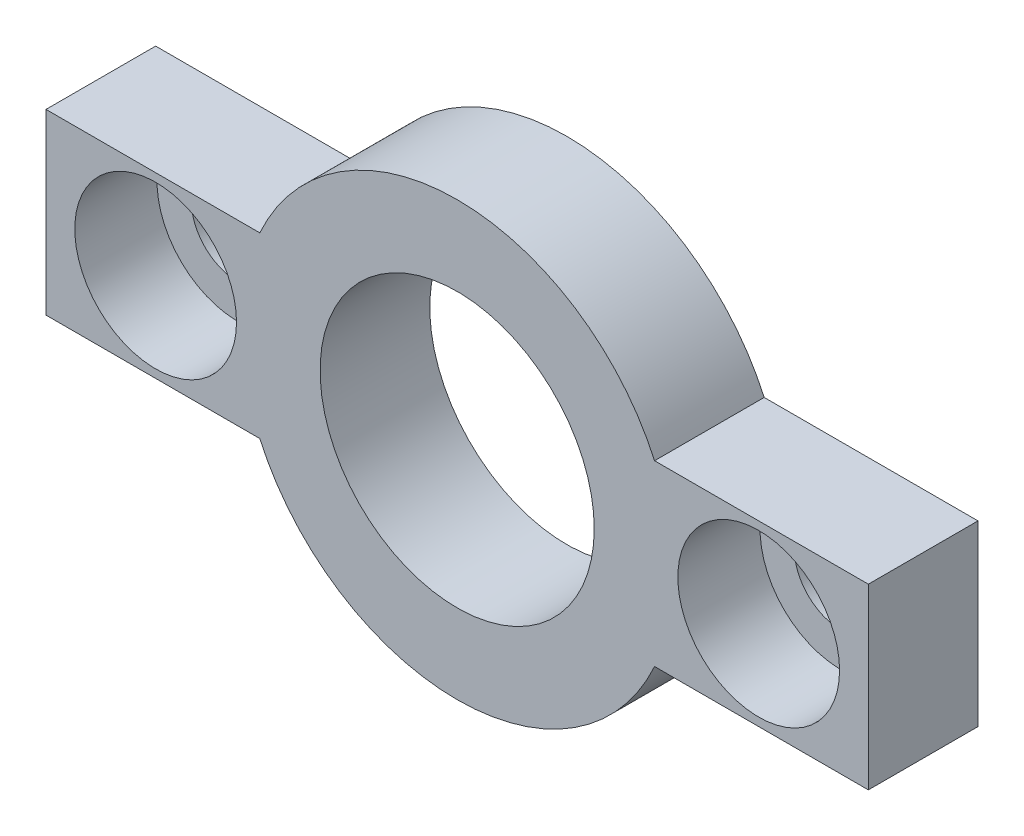
ISO-10303-21;
HEADER;
FILE_DESCRIPTION(('STEP AP214'),'2;1');
FILE_NAME('part.step','',(''),(''),'','','');
FILE_SCHEMA(('AUTOMOTIVE_DESIGN { 1 0 10303 214 1 1 1 1 }'));
ENDSEC;
DATA;
#1=APPLICATION_CONTEXT('core data for automotive mechanical design processes');
#2=APPLICATION_PROTOCOL_DEFINITION('international standard','automotive_design',2000,#1);
#3=PRODUCT_CONTEXT('',#1,'mechanical');
#4=PRODUCT('Part','Part','',(#3));
#5=PRODUCT_RELATED_PRODUCT_CATEGORY('part','',(#4));
#6=PRODUCT_DEFINITION_FORMATION('','',#4);
#7=PRODUCT_DEFINITION_CONTEXT('part definition',#1,'design');
#8=PRODUCT_DEFINITION('design','',#6,#7);
#9=PRODUCT_DEFINITION_SHAPE('','',#8);
#10=(LENGTH_UNIT() NAMED_UNIT(*) SI_UNIT(.MILLI.,.METRE.));
#11=(NAMED_UNIT(*) PLANE_ANGLE_UNIT() SI_UNIT($,.RADIAN.));
#12=(NAMED_UNIT(*) SI_UNIT($,.STERADIAN.) SOLID_ANGLE_UNIT());
#13=UNCERTAINTY_MEASURE_WITH_UNIT(LENGTH_MEASURE(1.E-05),#10,'distance_accuracy_value','');
#14=(GEOMETRIC_REPRESENTATION_CONTEXT(3) GLOBAL_UNCERTAINTY_ASSIGNED_CONTEXT((#13)) GLOBAL_UNIT_ASSIGNED_CONTEXT((#10,
#11,#12)) REPRESENTATION_CONTEXT('',''));
#15=CARTESIAN_POINT('',(0.,0.,0.));
#16=DIRECTION('',(0.,0.,1.));
#17=DIRECTION('',(1.,0.,0.));
#18=AXIS2_PLACEMENT_3D('',#15,#16,#17);
#19=CARTESIAN_POINT('',(11.,0.,0.));
#20=DIRECTION('',(0.,0.,1.));
#21=DIRECTION('',(1.,0.,0.));
#22=AXIS2_PLACEMENT_3D('',#19,#20,#21);
#23=CYLINDRICAL_SURFACE('',#22,1.7);
#24=CARTESIAN_POINT('',(11.,0.,0.));
#25=DIRECTION('',(0.,0.,1.));
#26=DIRECTION('',(1.,0.,0.));
#27=AXIS2_PLACEMENT_3D('',#24,#25,#26);
#28=CIRCLE('',#27,1.7);
#29=CARTESIAN_POINT('',(12.7,0.,0.));
#30=VERTEX_POINT('',#29);
#31=EDGE_CURVE('E193',#30,#30,#28,.T.);
#32=ORIENTED_EDGE('',*,*,#31,.F.);
#33=EDGE_LOOP('',(#32));
#34=FACE_BOUND('',#33,.T.);
#35=CARTESIAN_POINT('',(11.,0.,1.));
#36=DIRECTION('',(0.,0.,1.));
#37=DIRECTION('',(1.,0.,0.));
#38=AXIS2_PLACEMENT_3D('',#35,#36,#37);
#39=CIRCLE('',#38,1.7);
#40=CARTESIAN_POINT('',(12.7,0.,1.));
#41=VERTEX_POINT('',#40);
#42=EDGE_CURVE('E43',#41,#41,#39,.F.);
#43=ORIENTED_EDGE('',*,*,#42,.F.);
#44=EDGE_LOOP('',(#43));
#45=FACE_BOUND('',#44,.T.);
#46=ADVANCED_FACE('F39',(#34,#45),#23,.F.);
#47=CARTESIAN_POINT('',(-11.,0.,0.));
#48=DIRECTION('',(0.,0.,1.));
#49=DIRECTION('',(1.,0.,0.));
#50=AXIS2_PLACEMENT_3D('',#47,#48,#49);
#51=CYLINDRICAL_SURFACE('',#50,1.7);
#52=CARTESIAN_POINT('',(-11.,0.,0.));
#53=DIRECTION('',(0.,0.,1.));
#54=DIRECTION('',(1.,0.,0.));
#55=AXIS2_PLACEMENT_3D('',#52,#53,#54);
#56=CIRCLE('',#55,1.7);
#57=CARTESIAN_POINT('',(-9.3,0.,0.));
#58=VERTEX_POINT('',#57);
#59=EDGE_CURVE('E211',#58,#58,#56,.T.);
#60=ORIENTED_EDGE('',*,*,#59,.F.);
#61=EDGE_LOOP('',(#60));
#62=FACE_BOUND('',#61,.T.);
#63=CARTESIAN_POINT('',(-11.,0.,1.));
#64=DIRECTION('',(0.,0.,1.));
#65=DIRECTION('',(1.,0.,0.));
#66=AXIS2_PLACEMENT_3D('',#63,#64,#65);
#67=CIRCLE('',#66,1.7);
#68=CARTESIAN_POINT('',(-9.3,0.,1.));
#69=VERTEX_POINT('',#68);
#70=EDGE_CURVE('E184',#69,#69,#67,.F.);
#71=ORIENTED_EDGE('',*,*,#70,.F.);
#72=EDGE_LOOP('',(#71));
#73=FACE_BOUND('',#72,.T.);
#74=ADVANCED_FACE('F267',(#62,#73),#51,.F.);
#75=CARTESIAN_POINT('',(0.,0.,4.));
#76=DIRECTION('',(0.,0.,1.));
#77=DIRECTION('',(1.,0.,0.));
#78=AXIS2_PLACEMENT_3D('',#75,#76,#77);
#79=PLANE('',#78);
#80=CARTESIAN_POINT('',(-11.,0.,4.));
#81=DIRECTION('',(0.,0.,1.));
#82=DIRECTION('',(1.,0.,0.));
#83=AXIS2_PLACEMENT_3D('',#80,#81,#82);
#84=CIRCLE('',#83,2.95);
#85=CARTESIAN_POINT('',(-8.05,0.,4.));
#86=VERTEX_POINT('',#85);
#87=EDGE_CURVE('E195',#86,#86,#84,.T.);
#88=ORIENTED_EDGE('',*,*,#87,.F.);
#89=EDGE_LOOP('',(#88));
#90=FACE_BOUND('',#89,.T.);
#91=CARTESIAN_POINT('',(11.,0.,4.));
#92=DIRECTION('',(0.,0.,1.));
#93=DIRECTION('',(1.,0.,0.));
#94=AXIS2_PLACEMENT_3D('',#91,#92,#93);
#95=CIRCLE('',#94,2.95);
#96=CARTESIAN_POINT('',(13.95,0.,4.));
#97=VERTEX_POINT('',#96);
#98=EDGE_CURVE('E207',#97,#97,#95,.T.);
#99=ORIENTED_EDGE('',*,*,#98,.F.);
#100=EDGE_LOOP('',(#99));
#101=FACE_BOUND('',#100,.T.);
#102=DIRECTION('',(0.,-1.,0.));
#103=VECTOR('',#102,1.);
#104=CARTESIAN_POINT('',(-15.,-3.25,4.));
#105=LINE('',#104,#103);
#106=CARTESIAN_POINT('',(-15.,3.25,4.));
#107=VERTEX_POINT('',#106);
#108=CARTESIAN_POINT('',(-15.,-3.25,4.));
#109=VERTEX_POINT('',#108);
#110=EDGE_CURVE('E167',#107,#109,#105,.T.);
#111=ORIENTED_EDGE('',*,*,#110,.T.);
#112=DIRECTION('',(1.,0.,0.));
#113=VECTOR('',#112,1.);
#114=CARTESIAN_POINT('',(-7.20052081449669,-3.25,4.));
#115=LINE('',#114,#113);
#116=CARTESIAN_POINT('',(-7.20052081449669,-3.25,4.));
#117=VERTEX_POINT('',#116);
#118=EDGE_CURVE('E102',#109,#117,#115,.T.);
#119=ORIENTED_EDGE('',*,*,#118,.T.);
#120=CARTESIAN_POINT('',(0.,0.,4.));
#121=DIRECTION('',(0.,0.,1.));
#122=DIRECTION('',(1.,0.,0.));
#123=AXIS2_PLACEMENT_3D('',#120,#121,#122);
#124=CIRCLE('',#123,7.9);
#125=CARTESIAN_POINT('',(7.20052081449669,-3.25,4.));
#126=VERTEX_POINT('',#125);
#127=EDGE_CURVE('E229',#117,#126,#124,.T.);
#128=ORIENTED_EDGE('',*,*,#127,.T.);
#129=DIRECTION('',(1.,0.,0.));
#130=VECTOR('',#129,1.);
#131=CARTESIAN_POINT('',(15.,-3.25,4.));
#132=LINE('',#131,#130);
#133=CARTESIAN_POINT('',(15.,-3.25,4.));
#134=VERTEX_POINT('',#133);
#135=EDGE_CURVE('E232',#126,#134,#132,.T.);
#136=ORIENTED_EDGE('',*,*,#135,.T.);
#137=DIRECTION('',(0.,1.,0.));
#138=VECTOR('',#137,1.);
#139=CARTESIAN_POINT('',(15.,-3.25,4.));
#140=LINE('',#139,#138);
#141=CARTESIAN_POINT('',(15.,3.25,4.));
#142=VERTEX_POINT('',#141);
#143=EDGE_CURVE('E122',#134,#142,#140,.T.);
#144=ORIENTED_EDGE('',*,*,#143,.T.);
#145=DIRECTION('',(-1.,0.,0.));
#146=VECTOR('',#145,1.);
#147=CARTESIAN_POINT('',(15.,3.25,4.));
#148=LINE('',#147,#146);
#149=CARTESIAN_POINT('',(7.20052081449669,3.25,4.));
#150=VERTEX_POINT('',#149);
#151=EDGE_CURVE('E115',#142,#150,#148,.T.);
#152=ORIENTED_EDGE('',*,*,#151,.T.);
#153=CARTESIAN_POINT('',(0.,0.,4.));
#154=DIRECTION('',(0.,0.,1.));
#155=DIRECTION('',(1.,0.,0.));
#156=AXIS2_PLACEMENT_3D('',#153,#154,#155);
#157=CIRCLE('',#156,7.9);
#158=CARTESIAN_POINT('',(-7.20052081449669,3.25,4.));
#159=VERTEX_POINT('',#158);
#160=EDGE_CURVE('E120',#150,#159,#157,.T.);
#161=ORIENTED_EDGE('',*,*,#160,.T.);
#162=DIRECTION('',(-1.,0.,0.));
#163=VECTOR('',#162,1.);
#164=CARTESIAN_POINT('',(-7.20052081449669,3.25,4.));
#165=LINE('',#164,#163);
#166=EDGE_CURVE('E59',#159,#107,#165,.T.);
#167=ORIENTED_EDGE('',*,*,#166,.T.);
#168=EDGE_LOOP('',(#111,#119,#128,#136,#144,#152,#161,#167));
#169=FACE_BOUND('',#168,.T.);
#170=CARTESIAN_POINT('',(0.,0.,4.));
#171=DIRECTION('',(0.,0.,1.));
#172=DIRECTION('',(1.,0.,0.));
#173=AXIS2_PLACEMENT_3D('',#170,#171,#172);
#174=CIRCLE('',#173,5.);
#175=CARTESIAN_POINT('',(5.,0.,4.));
#176=VERTEX_POINT('',#175);
#177=EDGE_CURVE('E149',#176,#176,#174,.T.);
#178=ORIENTED_EDGE('',*,*,#177,.F.);
#179=EDGE_LOOP('',(#178));
#180=FACE_BOUND('',#179,.T.);
#181=ADVANCED_FACE('F117',(#90,#101,#169,#180),#79,.T.);
#182=CARTESIAN_POINT('',(0.,0.,0.));
#183=DIRECTION('',(0.,0.,1.));
#184=DIRECTION('',(1.,0.,0.));
#185=AXIS2_PLACEMENT_3D('',#182,#183,#184);
#186=PLANE('',#185);
#187=ORIENTED_EDGE('',*,*,#59,.T.);
#188=EDGE_LOOP('',(#187));
#189=FACE_BOUND('',#188,.T.);
#190=ORIENTED_EDGE('',*,*,#31,.T.);
#191=EDGE_LOOP('',(#190));
#192=FACE_BOUND('',#191,.T.);
#193=DIRECTION('',(0.,-1.,0.));
#194=VECTOR('',#193,1.);
#195=CARTESIAN_POINT('',(-15.,-3.25,0.));
#196=LINE('',#195,#194);
#197=CARTESIAN_POINT('',(-15.,3.25,0.));
#198=VERTEX_POINT('',#197);
#199=CARTESIAN_POINT('',(-15.,-3.25,0.));
#200=VERTEX_POINT('',#199);
#201=EDGE_CURVE('E144',#198,#200,#196,.T.);
#202=ORIENTED_EDGE('',*,*,#201,.F.);
#203=DIRECTION('',(-1.,0.,0.));
#204=VECTOR('',#203,1.);
#205=CARTESIAN_POINT('',(-7.20052081449669,3.25,0.));
#206=LINE('',#205,#204);
#207=CARTESIAN_POINT('',(-7.20052081449669,3.25,0.));
#208=VERTEX_POINT('',#207);
#209=EDGE_CURVE('E94',#208,#198,#206,.T.);
#210=ORIENTED_EDGE('',*,*,#209,.F.);
#211=CARTESIAN_POINT('',(0.,0.,0.));
#212=DIRECTION('',(0.,0.,1.));
#213=DIRECTION('',(1.,0.,0.));
#214=AXIS2_PLACEMENT_3D('',#211,#212,#213);
#215=CIRCLE('',#214,7.9);
#216=CARTESIAN_POINT('',(7.20052081449669,3.25,0.));
#217=VERTEX_POINT('',#216);
#218=EDGE_CURVE('E88',#217,#208,#215,.T.);
#219=ORIENTED_EDGE('',*,*,#218,.F.);
#220=DIRECTION('',(-1.,0.,0.));
#221=VECTOR('',#220,1.);
#222=CARTESIAN_POINT('',(15.,3.25,0.));
#223=LINE('',#222,#221);
#224=CARTESIAN_POINT('',(15.,3.25,0.));
#225=VERTEX_POINT('',#224);
#226=EDGE_CURVE('E131',#225,#217,#223,.T.);
#227=ORIENTED_EDGE('',*,*,#226,.F.);
#228=DIRECTION('',(0.,1.,0.));
#229=VECTOR('',#228,1.);
#230=CARTESIAN_POINT('',(15.,-3.25,0.));
#231=LINE('',#230,#229);
#232=CARTESIAN_POINT('',(15.,-3.25,0.));
#233=VERTEX_POINT('',#232);
#234=EDGE_CURVE('E158',#233,#225,#231,.T.);
#235=ORIENTED_EDGE('',*,*,#234,.F.);
#236=DIRECTION('',(1.,0.,0.));
#237=VECTOR('',#236,1.);
#238=CARTESIAN_POINT('',(15.,-3.25,0.));
#239=LINE('',#238,#237);
#240=CARTESIAN_POINT('',(7.20052081449669,-3.25,0.));
#241=VERTEX_POINT('',#240);
#242=EDGE_CURVE('E155',#241,#233,#239,.T.);
#243=ORIENTED_EDGE('',*,*,#242,.F.);
#244=CARTESIAN_POINT('',(0.,0.,0.));
#245=DIRECTION('',(0.,0.,1.));
#246=DIRECTION('',(1.,0.,0.));
#247=AXIS2_PLACEMENT_3D('',#244,#245,#246);
#248=CIRCLE('',#247,7.9);
#249=CARTESIAN_POINT('',(-7.20052081449669,-3.25,0.));
#250=VERTEX_POINT('',#249);
#251=EDGE_CURVE('E152',#250,#241,#248,.T.);
#252=ORIENTED_EDGE('',*,*,#251,.F.);
#253=DIRECTION('',(1.,0.,0.));
#254=VECTOR('',#253,1.);
#255=CARTESIAN_POINT('',(-7.20052081449669,-3.25,0.));
#256=LINE('',#255,#254);
#257=EDGE_CURVE('E148',#200,#250,#256,.T.);
#258=ORIENTED_EDGE('',*,*,#257,.F.);
#259=EDGE_LOOP('',(#202,#210,#219,#227,#235,#243,#252,#258));
#260=FACE_BOUND('',#259,.T.);
#261=CARTESIAN_POINT('',(0.,0.,0.));
#262=DIRECTION('',(0.,0.,1.));
#263=DIRECTION('',(1.,0.,0.));
#264=AXIS2_PLACEMENT_3D('',#261,#262,#263);
#265=CIRCLE('',#264,5.);
#266=CARTESIAN_POINT('',(5.,0.,0.));
#267=VERTEX_POINT('',#266);
#268=EDGE_CURVE('E215',#267,#267,#265,.T.);
#269=ORIENTED_EDGE('',*,*,#268,.T.);
#270=EDGE_LOOP('',(#269));
#271=FACE_BOUND('',#270,.T.);
#272=ADVANCED_FACE('F247',(#189,#192,#260,#271),#186,.F.);
#273=CARTESIAN_POINT('',(-15.,-3.25,4.));
#274=DIRECTION('',(1.,0.,0.));
#275=DIRECTION('',(0.,0.,-1.));
#276=AXIS2_PLACEMENT_3D('',#273,#274,#275);
#277=PLANE('',#276);
#278=ORIENTED_EDGE('',*,*,#201,.T.);
#279=DIRECTION('',(0.,0.,-1.));
#280=VECTOR('',#279,1.);
#281=CARTESIAN_POINT('',(-15.,-3.25,4.));
#282=LINE('',#281,#280);
#283=EDGE_CURVE('E11',#109,#200,#282,.T.);
#284=ORIENTED_EDGE('',*,*,#283,.F.);
#285=ORIENTED_EDGE('',*,*,#110,.F.);
#286=DIRECTION('',(0.,0.,-1.));
#287=VECTOR('',#286,1.);
#288=CARTESIAN_POINT('',(-15.,3.25,4.));
#289=LINE('',#288,#287);
#290=EDGE_CURVE('E140',#107,#198,#289,.T.);
#291=ORIENTED_EDGE('',*,*,#290,.T.);
#292=EDGE_LOOP('',(#278,#284,#285,#291));
#293=FACE_BOUND('',#292,.T.);
#294=ADVANCED_FACE('F41',(#293),#277,.F.);
#295=CARTESIAN_POINT('',(-7.20052081449669,-3.25,4.));
#296=DIRECTION('',(0.,1.,0.));
#297=DIRECTION('',(-1.,0.,0.));
#298=AXIS2_PLACEMENT_3D('',#295,#296,#297);
#299=PLANE('',#298);
#300=ORIENTED_EDGE('',*,*,#257,.T.);
#301=DIRECTION('',(0.,0.,-1.));
#302=VECTOR('',#301,1.);
#303=CARTESIAN_POINT('',(-7.20052081449669,-3.25,4.));
#304=LINE('',#303,#302);
#305=EDGE_CURVE('E50',#117,#250,#304,.T.);
#306=ORIENTED_EDGE('',*,*,#305,.F.);
#307=ORIENTED_EDGE('',*,*,#118,.F.);
#308=ORIENTED_EDGE('',*,*,#283,.T.);
#309=EDGE_LOOP('',(#300,#306,#307,#308));
#310=FACE_BOUND('',#309,.T.);
#311=ADVANCED_FACE('F286',(#310),#299,.F.);
#312=CARTESIAN_POINT('',(0.,0.,4.));
#313=DIRECTION('',(0.,0.,-1.));
#314=DIRECTION('',(-1.,0.,0.));
#315=AXIS2_PLACEMENT_3D('',#312,#313,#314);
#316=CYLINDRICAL_SURFACE('',#315,7.9);
#317=ORIENTED_EDGE('',*,*,#251,.T.);
#318=DIRECTION('',(0.,0.,-1.));
#319=VECTOR('',#318,1.);
#320=CARTESIAN_POINT('',(7.20052081449669,-3.25,4.));
#321=LINE('',#320,#319);
#322=EDGE_CURVE('E178',#126,#241,#321,.T.);
#323=ORIENTED_EDGE('',*,*,#322,.F.);
#324=ORIENTED_EDGE('',*,*,#127,.F.);
#325=ORIENTED_EDGE('',*,*,#305,.T.);
#326=EDGE_LOOP('',(#317,#323,#324,#325));
#327=FACE_BOUND('',#326,.T.);
#328=ADVANCED_FACE('F293',(#327),#316,.T.);
#329=CARTESIAN_POINT('',(15.,-3.25,4.));
#330=DIRECTION('',(0.,1.,0.));
#331=DIRECTION('',(-1.,0.,0.));
#332=AXIS2_PLACEMENT_3D('',#329,#330,#331);
#333=PLANE('',#332);
#334=ORIENTED_EDGE('',*,*,#242,.T.);
#335=DIRECTION('',(0.,0.,-1.));
#336=VECTOR('',#335,1.);
#337=CARTESIAN_POINT('',(15.,-3.25,4.));
#338=LINE('',#337,#336);
#339=EDGE_CURVE('E174',#134,#233,#338,.T.);
#340=ORIENTED_EDGE('',*,*,#339,.F.);
#341=ORIENTED_EDGE('',*,*,#135,.F.);
#342=ORIENTED_EDGE('',*,*,#322,.T.);
#343=EDGE_LOOP('',(#334,#340,#341,#342));
#344=FACE_BOUND('',#343,.T.);
#345=ADVANCED_FACE('F240',(#344),#333,.F.);
#346=CARTESIAN_POINT('',(15.,-3.25,4.));
#347=DIRECTION('',(-1.,0.,0.));
#348=DIRECTION('',(0.,-1.,0.));
#349=AXIS2_PLACEMENT_3D('',#346,#347,#348);
#350=PLANE('',#349);
#351=ORIENTED_EDGE('',*,*,#234,.T.);
#352=DIRECTION('',(0.,0.,-1.));
#353=VECTOR('',#352,1.);
#354=CARTESIAN_POINT('',(15.,3.25,4.));
#355=LINE('',#354,#353);
#356=EDGE_CURVE('E133',#142,#225,#355,.T.);
#357=ORIENTED_EDGE('',*,*,#356,.F.);
#358=ORIENTED_EDGE('',*,*,#143,.F.);
#359=ORIENTED_EDGE('',*,*,#339,.T.);
#360=EDGE_LOOP('',(#351,#357,#358,#359));
#361=FACE_BOUND('',#360,.T.);
#362=ADVANCED_FACE('F244',(#361),#350,.F.);
#363=CARTESIAN_POINT('',(15.,3.25,4.));
#364=DIRECTION('',(0.,-1.,0.));
#365=DIRECTION('',(1.,0.,0.));
#366=AXIS2_PLACEMENT_3D('',#363,#364,#365);
#367=PLANE('',#366);
#368=ORIENTED_EDGE('',*,*,#226,.T.);
#369=DIRECTION('',(0.,0.,-1.));
#370=VECTOR('',#369,1.);
#371=CARTESIAN_POINT('',(7.20052081449669,3.25,4.));
#372=LINE('',#371,#370);
#373=EDGE_CURVE('E128',#150,#217,#372,.T.);
#374=ORIENTED_EDGE('',*,*,#373,.F.);
#375=ORIENTED_EDGE('',*,*,#151,.F.);
#376=ORIENTED_EDGE('',*,*,#356,.T.);
#377=EDGE_LOOP('',(#368,#374,#375,#376));
#378=FACE_BOUND('',#377,.T.);
#379=ADVANCED_FACE('F129',(#378),#367,.F.);
#380=CARTESIAN_POINT('',(0.,0.,4.));
#381=DIRECTION('',(0.,0.,-1.));
#382=DIRECTION('',(-1.,0.,0.));
#383=AXIS2_PLACEMENT_3D('',#380,#381,#382);
#384=CYLINDRICAL_SURFACE('',#383,7.9);
#385=ORIENTED_EDGE('',*,*,#218,.T.);
#386=DIRECTION('',(0.,0.,-1.));
#387=VECTOR('',#386,1.);
#388=CARTESIAN_POINT('',(-7.20052081449669,3.25,4.));
#389=LINE('',#388,#387);
#390=EDGE_CURVE('E134',#159,#208,#389,.T.);
#391=ORIENTED_EDGE('',*,*,#390,.F.);
#392=ORIENTED_EDGE('',*,*,#160,.F.);
#393=ORIENTED_EDGE('',*,*,#373,.T.);
#394=EDGE_LOOP('',(#385,#391,#392,#393));
#395=FACE_BOUND('',#394,.T.);
#396=ADVANCED_FACE('F136',(#395),#384,.T.);
#397=CARTESIAN_POINT('',(-7.20052081449669,3.25,4.));
#398=DIRECTION('',(0.,-1.,0.));
#399=DIRECTION('',(1.,0.,0.));
#400=AXIS2_PLACEMENT_3D('',#397,#398,#399);
#401=PLANE('',#400);
#402=ORIENTED_EDGE('',*,*,#209,.T.);
#403=ORIENTED_EDGE('',*,*,#290,.F.);
#404=ORIENTED_EDGE('',*,*,#166,.F.);
#405=ORIENTED_EDGE('',*,*,#390,.T.);
#406=EDGE_LOOP('',(#402,#403,#404,#405));
#407=FACE_BOUND('',#406,.T.);
#408=ADVANCED_FACE('F253',(#407),#401,.F.);
#409=CARTESIAN_POINT('',(0.,0.,4.));
#410=DIRECTION('',(0.,0.,-1.));
#411=DIRECTION('',(-1.,0.,0.));
#412=AXIS2_PLACEMENT_3D('',#409,#410,#411);
#413=CYLINDRICAL_SURFACE('',#412,5.);
#414=ORIENTED_EDGE('',*,*,#177,.T.);
#415=EDGE_LOOP('',(#414));
#416=FACE_BOUND('',#415,.T.);
#417=ORIENTED_EDGE('',*,*,#268,.F.);
#418=EDGE_LOOP('',(#417));
#419=FACE_BOUND('',#418,.T.);
#420=ADVANCED_FACE('F255',(#416,#419),#413,.F.);
#421=CARTESIAN_POINT('',(-11.,0.,1.));
#422=DIRECTION('',(0.,0.,1.));
#423=DIRECTION('',(1.,0.,0.));
#424=AXIS2_PLACEMENT_3D('',#421,#422,#423);
#425=PLANE('',#424);
#426=CARTESIAN_POINT('',(-11.,0.,1.));
#427=DIRECTION('',(0.,0.,1.));
#428=DIRECTION('',(1.,0.,0.));
#429=AXIS2_PLACEMENT_3D('',#426,#427,#428);
#430=CIRCLE('',#429,2.95);
#431=CARTESIAN_POINT('',(-8.05,0.,1.));
#432=VERTEX_POINT('',#431);
#433=EDGE_CURVE('E187',#432,#432,#430,.T.);
#434=ORIENTED_EDGE('',*,*,#433,.T.);
#435=EDGE_LOOP('',(#434));
#436=FACE_BOUND('',#435,.T.);
#437=ORIENTED_EDGE('',*,*,#70,.T.);
#438=EDGE_LOOP('',(#437));
#439=FACE_BOUND('',#438,.T.);
#440=ADVANCED_FACE('F261',(#436,#439),#425,.T.);
#441=CARTESIAN_POINT('',(-11.,0.,1.));
#442=DIRECTION('',(0.,0.,1.));
#443=DIRECTION('',(1.,0.,0.));
#444=AXIS2_PLACEMENT_3D('',#441,#442,#443);
#445=CYLINDRICAL_SURFACE('',#444,2.95);
#446=ORIENTED_EDGE('',*,*,#433,.F.);
#447=EDGE_LOOP('',(#446));
#448=FACE_BOUND('',#447,.T.);
#449=ORIENTED_EDGE('',*,*,#87,.T.);
#450=EDGE_LOOP('',(#449));
#451=FACE_BOUND('',#450,.T.);
#452=ADVANCED_FACE('F353',(#448,#451),#445,.F.);
#453=CARTESIAN_POINT('',(11.,0.,1.));
#454=DIRECTION('',(0.,0.,1.));
#455=DIRECTION('',(1.,0.,0.));
#456=AXIS2_PLACEMENT_3D('',#453,#454,#455);
#457=PLANE('',#456);
#458=CARTESIAN_POINT('',(11.,0.,1.));
#459=DIRECTION('',(0.,0.,1.));
#460=DIRECTION('',(1.,0.,0.));
#461=AXIS2_PLACEMENT_3D('',#458,#459,#460);
#462=CIRCLE('',#461,2.95);
#463=CARTESIAN_POINT('',(13.95,0.,1.));
#464=VERTEX_POINT('',#463);
#465=EDGE_CURVE('E201',#464,#464,#462,.T.);
#466=ORIENTED_EDGE('',*,*,#465,.T.);
#467=EDGE_LOOP('',(#466));
#468=FACE_BOUND('',#467,.T.);
#469=ORIENTED_EDGE('',*,*,#42,.T.);
#470=EDGE_LOOP('',(#469));
#471=FACE_BOUND('',#470,.T.);
#472=ADVANCED_FACE('F362',(#468,#471),#457,.T.);
#473=CARTESIAN_POINT('',(11.,0.,1.));
#474=DIRECTION('',(0.,0.,1.));
#475=DIRECTION('',(1.,0.,0.));
#476=AXIS2_PLACEMENT_3D('',#473,#474,#475);
#477=CYLINDRICAL_SURFACE('',#476,2.95);
#478=ORIENTED_EDGE('',*,*,#465,.F.);
#479=EDGE_LOOP('',(#478));
#480=FACE_BOUND('',#479,.T.);
#481=ORIENTED_EDGE('',*,*,#98,.T.);
#482=EDGE_LOOP('',(#481));
#483=FACE_BOUND('',#482,.T.);
#484=ADVANCED_FACE('F372',(#480,#483),#477,.F.);
#485=CLOSED_SHELL('',(#46,#74,#181,#272,#294,#311,#328,#345,#362,#379,#396,#408,#420,#440,#452,
#472,#484));
#486=MANIFOLD_SOLID_BREP('B2',#485);
#487=ADVANCED_BREP_SHAPE_REPRESENTATION('',(#18,#486),#14);
#488=SHAPE_DEFINITION_REPRESENTATION(#9,#487);
ENDSEC;
END-ISO-10303-21;
